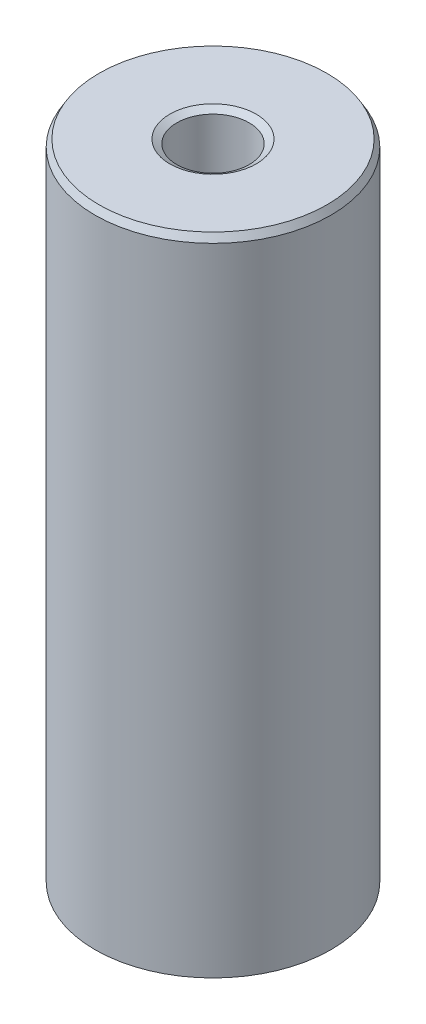
ISO-10303-21;
HEADER;
FILE_DESCRIPTION(('STEP AP214'),'2;1');
FILE_NAME('part.step','',(''),(''),'','','');
FILE_SCHEMA(('AUTOMOTIVE_DESIGN { 1 0 10303 214 1 1 1 1 }'));
ENDSEC;
DATA;
#1=APPLICATION_CONTEXT('core data for automotive mechanical design processes');
#2=APPLICATION_PROTOCOL_DEFINITION('international standard','automotive_design',2000,#1);
#3=PRODUCT_CONTEXT('',#1,'mechanical');
#4=PRODUCT('Part','Part','',(#3));
#5=PRODUCT_RELATED_PRODUCT_CATEGORY('part','',(#4));
#6=PRODUCT_DEFINITION_FORMATION('','',#4);
#7=PRODUCT_DEFINITION_CONTEXT('part definition',#1,'design');
#8=PRODUCT_DEFINITION('design','',#6,#7);
#9=PRODUCT_DEFINITION_SHAPE('','',#8);
#10=(LENGTH_UNIT() NAMED_UNIT(*) SI_UNIT(.MILLI.,.METRE.));
#11=(NAMED_UNIT(*) PLANE_ANGLE_UNIT() SI_UNIT($,.RADIAN.));
#12=(NAMED_UNIT(*) SI_UNIT($,.STERADIAN.) SOLID_ANGLE_UNIT());
#13=UNCERTAINTY_MEASURE_WITH_UNIT(LENGTH_MEASURE(1.E-05),#10,'distance_accuracy_value','');
#14=(GEOMETRIC_REPRESENTATION_CONTEXT(3) GLOBAL_UNCERTAINTY_ASSIGNED_CONTEXT((#13)) GLOBAL_UNIT_ASSIGNED_CONTEXT((#10,
#11,#12)) REPRESENTATION_CONTEXT('',''));
#15=CARTESIAN_POINT('',(0.,0.,0.));
#16=DIRECTION('',(0.,0.,1.));
#17=DIRECTION('',(1.,0.,0.));
#18=AXIS2_PLACEMENT_3D('',#15,#16,#17);
#19=CARTESIAN_POINT('',(0.,27.4315603410785,0.));
#20=DIRECTION('',(0.,-1.,0.));
#21=DIRECTION('',(0.,0.,-1.));
#22=AXIS2_PLACEMENT_3D('',#19,#20,#21);
#23=CYLINDRICAL_SURFACE('',#22,5.);
#24=CARTESIAN_POINT('',(0.,0.170210936840057,0.));
#25=DIRECTION('',(0.,1.,0.));
#26=DIRECTION('',(0.,0.,1.));
#27=AXIS2_PLACEMENT_3D('',#24,#25,#26);
#28=CIRCLE('',#27,5.);
#29=CARTESIAN_POINT('',(0.,0.170210936840054,-5.));
#30=VERTEX_POINT('',#29);
#31=EDGE_CURVE('E10',#30,#30,#28,.T.);
#32=CARTESIAN_POINT('',(0.,27.1367463504676,0.));
#33=DIRECTION('',(0.,1.,0.));
#34=DIRECTION('',(0.,0.,1.));
#35=AXIS2_PLACEMENT_3D('',#32,#33,#34);
#36=CIRCLE('',#35,5.);
#37=CARTESIAN_POINT('',(0.,27.1367463504676,-5.));
#38=VERTEX_POINT('',#37);
#39=EDGE_CURVE('E50',#38,#38,#36,.F.);
#40=CARTESIAN_POINT('',(0.,0.170210936840054,-5.));
#41=CARTESIAN_POINT('',(0.,0.451112347398675,-5.));
#42=CARTESIAN_POINT('',(0.,0.732013757957295,-5.));
#43=CARTESIAN_POINT('',(0.,1.29381657907454,-5.));
#44=CARTESIAN_POINT('',(0.,1.57471798963316,-5.));
#45=CARTESIAN_POINT('',(0.,2.1365208107504,-5.));
#46=CARTESIAN_POINT('',(0.,2.41742222130902,-5.));
#47=CARTESIAN_POINT('',(0.,2.97922504242626,-5.));
#48=CARTESIAN_POINT('',(0.,3.26012645298488,-5.));
#49=CARTESIAN_POINT('',(0.,3.82192927410212,-5.));
#50=CARTESIAN_POINT('',(0.,4.10283068466074,-5.));
#51=CARTESIAN_POINT('',(0.,4.66463350577798,-5.));
#52=CARTESIAN_POINT('',(0.,4.9455349163366,-5.));
#53=CARTESIAN_POINT('',(0.,5.50733773745384,-5.));
#54=CARTESIAN_POINT('',(0.,5.78823914801246,-5.));
#55=CARTESIAN_POINT('',(0.,6.3500419691297,-5.));
#56=CARTESIAN_POINT('',(0.,6.63094337968832,-5.));
#57=CARTESIAN_POINT('',(0.,7.19274620080556,-5.));
#58=CARTESIAN_POINT('',(0.,7.47364761136418,-5.));
#59=CARTESIAN_POINT('',(0.,8.03545043248142,-5.));
#60=CARTESIAN_POINT('',(0.,8.31635184304004,-5.));
#61=CARTESIAN_POINT('',(0.,8.87815466415728,-5.));
#62=CARTESIAN_POINT('',(0.,9.1590560747159,-5.));
#63=CARTESIAN_POINT('',(0.,9.72085889583314,-5.));
#64=CARTESIAN_POINT('',(0.,10.0017603063918,-5.));
#65=CARTESIAN_POINT('',(0.,10.563563127509,-5.));
#66=CARTESIAN_POINT('',(0.,10.8444645380676,-5.));
#67=CARTESIAN_POINT('',(0.,11.4062673591849,-5.));
#68=CARTESIAN_POINT('',(0.,11.6871687697435,-5.));
#69=CARTESIAN_POINT('',(0.,12.2489715908607,-5.));
#70=CARTESIAN_POINT('',(0.,12.5298730014193,-5.));
#71=CARTESIAN_POINT('',(0.,13.0916758225366,-5.));
#72=CARTESIAN_POINT('',(0.,13.3725772330952,-5.));
#73=CARTESIAN_POINT('',(0.,13.9343800542124,-5.));
#74=CARTESIAN_POINT('',(0.,14.2152814647711,-5.));
#75=CARTESIAN_POINT('',(0.,14.7770842858883,-5.));
#76=CARTESIAN_POINT('',(0.,15.0579856964469,-5.));
#77=CARTESIAN_POINT('',(0.,15.6197885175642,-5.));
#78=CARTESIAN_POINT('',(0.,15.9006899281228,-5.));
#79=CARTESIAN_POINT('',(0.,16.46249274924,-5.));
#80=CARTESIAN_POINT('',(0.,16.7433941597987,-5.));
#81=CARTESIAN_POINT('',(0.,17.3051969809159,-5.));
#82=CARTESIAN_POINT('',(0.,17.5860983914745,-5.));
#83=CARTESIAN_POINT('',(0.,18.1479012125918,-5.));
#84=CARTESIAN_POINT('',(0.,18.4288026231504,-5.));
#85=CARTESIAN_POINT('',(0.,18.9906054442676,-5.));
#86=CARTESIAN_POINT('',(0.,19.2715068548262,-5.));
#87=CARTESIAN_POINT('',(0.,19.8333096759435,-5.));
#88=CARTESIAN_POINT('',(0.,20.1142110865021,-5.));
#89=CARTESIAN_POINT('',(0.,20.6760139076193,-5.));
#90=CARTESIAN_POINT('',(0.,20.956915318178,-5.));
#91=CARTESIAN_POINT('',(0.,21.5187181392952,-5.));
#92=CARTESIAN_POINT('',(0.,21.7996195498538,-5.));
#93=CARTESIAN_POINT('',(0.,22.3614223709711,-5.));
#94=CARTESIAN_POINT('',(0.,22.6423237815297,-5.));
#95=CARTESIAN_POINT('',(0.,23.2041266026469,-5.));
#96=CARTESIAN_POINT('',(0.,23.4850280132055,-5.));
#97=CARTESIAN_POINT('',(0.,24.0468308343228,-5.));
#98=CARTESIAN_POINT('',(0.,24.3277322448814,-5.));
#99=CARTESIAN_POINT('',(0.,24.8895350659986,-5.));
#100=CARTESIAN_POINT('',(0.,25.1704364765573,-5.));
#101=CARTESIAN_POINT('',(0.,25.7322392976745,-5.));
#102=CARTESIAN_POINT('',(0.,26.0131407082331,-5.));
#103=CARTESIAN_POINT('',(0.,26.5749435293504,-5.));
#104=CARTESIAN_POINT('',(0.,26.855844939909,-5.));
#105=CARTESIAN_POINT('',(0.,27.1367463504676,-5.));
#106=B_SPLINE_CURVE_WITH_KNOTS('',3,(#40,#41,#42,#43,#44,#45,#46,#47,#48,#49,#50,#51,#52,#53,
#54,#55,#56,#57,#58,#59,#60,#61,#62,#63,#64,#65,#66,#67,#68,#69,#70,#71,#72,#73,#74,#75,#76,#77,
#78,#79,#80,#81,#82,#83,#84,#85,#86,#87,#88,#89,#90,#91,#92,#93,#94,#95,#96,#97,#98,#99,#100,
#101,#102,#103,#104,#105),.UNSPECIFIED.,.F.,.F.,(4,2,2,2,2,2,2,2,2,2,2,2,2,2,2,2,2,2,2,2,2,2,2,
2,2,2,2,2,2,2,2,2,4),(0.,0.842704231675862,1.68540846335172,2.52811269502758,3.37081692670344,
4.2135211583793,5.05622539005517,5.89892962173102,6.74163385340689,7.58433808508275,
8.42704231675861,9.26974654843447,10.1124507801103,10.9551550117862,11.7978592434621,
12.6405634751379,13.4832677068138,14.3259719384896,15.1686761701655,16.0113804018414,
16.8540846335172,17.6967888651931,18.5394930968689,19.3821973285448,20.2249015602207,
21.0676057918965,21.9103100235724,22.7530142552482,23.5957184869241,24.4384227186,
25.2811269502758,26.1238311819517,26.9665354136275),.UNSPECIFIED.);
#107=EDGE_CURVE('BSEAM39',#30,#38,#106,.T.);
#108=ORIENTED_EDGE('',*,*,#31,.T.);
#109=ORIENTED_EDGE('',*,*,#39,.T.);
#110=ORIENTED_EDGE('',*,*,#107,.T.);
#111=ORIENTED_EDGE('',*,*,#107,.F.);
#112=EDGE_LOOP('',(#108,#110,#109,#111));
#113=FACE_BOUND('',#112,.T.);
#114=ADVANCED_FACE('F39',(#113),#23,.T.);
#115=CARTESIAN_POINT('',(0.,27.4315603410785,0.));
#116=DIRECTION('',(0.,1.,0.));
#117=DIRECTION('',(0.,0.,1.));
#118=AXIS2_PLACEMENT_3D('',#115,#116,#117);
#119=PLANE('',#118);
#120=CARTESIAN_POINT('',(0.,27.4315603410785,0.));
#121=DIRECTION('',(0.,1.,0.));
#122=DIRECTION('',(0.,0.,1.));
#123=AXIS2_PLACEMENT_3D('',#120,#121,#122);
#124=CIRCLE('',#123,1.83019866154307);
#125=CARTESIAN_POINT('',(0.,27.4315603410785,1.83019866154307));
#126=VERTEX_POINT('',#125);
#127=EDGE_CURVE('E58',#126,#126,#124,.F.);
#128=ORIENTED_EDGE('',*,*,#127,.T.);
#129=EDGE_LOOP('',(#128));
#130=FACE_BOUND('',#129,.T.);
#131=CARTESIAN_POINT('',(0.,27.4315603410785,0.));
#132=DIRECTION('',(0.,1.,0.));
#133=DIRECTION('',(0.,0.,1.));
#134=AXIS2_PLACEMENT_3D('',#131,#132,#133);
#135=CIRCLE('',#134,4.82978906315996);
#136=CARTESIAN_POINT('',(0.,27.4315603410785,4.82978906315996));
#137=VERTEX_POINT('',#136);
#138=EDGE_CURVE('E61',#137,#137,#135,.T.);
#139=ORIENTED_EDGE('',*,*,#138,.T.);
#140=EDGE_LOOP('',(#139));
#141=FACE_BOUND('',#140,.T.);
#142=ADVANCED_FACE('F88',(#130,#141),#119,.T.);
#143=CARTESIAN_POINT('',(0.,0.,0.));
#144=DIRECTION('',(0.,1.,0.));
#145=DIRECTION('',(0.,0.,1.));
#146=AXIS2_PLACEMENT_3D('',#143,#144,#145);
#147=PLANE('',#146);
#148=CARTESIAN_POINT('',(0.,0.,0.));
#149=DIRECTION('',(0.,1.,0.));
#150=DIRECTION('',(0.,0.,1.));
#151=AXIS2_PLACEMENT_3D('',#148,#149,#150);
#152=CIRCLE('',#151,1.70559560777225);
#153=CARTESIAN_POINT('',(0.,0.,1.70559560777225));
#154=VERTEX_POINT('',#153);
#155=EDGE_CURVE('E51',#154,#154,#152,.T.);
#156=ORIENTED_EDGE('',*,*,#155,.T.);
#157=EDGE_LOOP('',(#156));
#158=FACE_BOUND('',#157,.T.);
#159=CARTESIAN_POINT('',(0.,0.,0.));
#160=DIRECTION('',(0.,1.,0.));
#161=DIRECTION('',(0.,0.,1.));
#162=AXIS2_PLACEMENT_3D('',#159,#160,#161);
#163=CIRCLE('',#162,4.70518600938912);
#164=CARTESIAN_POINT('',(0.,0.,4.70518600938912));
#165=VERTEX_POINT('',#164);
#166=EDGE_CURVE('E54',#165,#165,#163,.F.);
#167=ORIENTED_EDGE('',*,*,#166,.T.);
#168=EDGE_LOOP('',(#167));
#169=FACE_BOUND('',#168,.T.);
#170=ADVANCED_FACE('F83',(#158,#169),#147,.F.);
#171=CARTESIAN_POINT('',(0.,27.4315603410785,0.));
#172=DIRECTION('',(0.,-1.,0.));
#173=DIRECTION('',(0.,0.,-1.));
#174=AXIS2_PLACEMENT_3D('',#171,#172,#173);
#175=CYLINDRICAL_SURFACE('',#174,1.53538467093221);
#176=CARTESIAN_POINT('',(0.,27.2613494042384,0.));
#177=DIRECTION('',(0.,1.,0.));
#178=DIRECTION('',(0.,0.,1.));
#179=AXIS2_PLACEMENT_3D('',#176,#177,#178);
#180=CIRCLE('',#179,1.53538467093221);
#181=CARTESIAN_POINT('',(0.,27.2613494042384,-1.53538467093221));
#182=VERTEX_POINT('',#181);
#183=EDGE_CURVE('E67',#182,#182,#180,.T.);
#184=CARTESIAN_POINT('',(0.,0.294813990610859,0.));
#185=DIRECTION('',(0.,1.,0.));
#186=DIRECTION('',(0.,0.,1.));
#187=AXIS2_PLACEMENT_3D('',#184,#185,#186);
#188=CIRCLE('',#187,1.53538467093221);
#189=CARTESIAN_POINT('',(0.,0.294813990610855,-1.53538467093221));
#190=VERTEX_POINT('',#189);
#191=EDGE_CURVE('E69',#190,#190,#188,.F.);
#192=CARTESIAN_POINT('',(0.,27.2613494042384,-1.53538467093221));
#193=CARTESIAN_POINT('',(0.,26.9804479936798,-1.53538467093221));
#194=CARTESIAN_POINT('',(0.,26.6995465831212,-1.53538467093221));
#195=CARTESIAN_POINT('',(0.,26.1377437620039,-1.53538467093221));
#196=CARTESIAN_POINT('',(0.,25.8568423514453,-1.53538467093221));
#197=CARTESIAN_POINT('',(0.,25.2950395303281,-1.53538467093221));
#198=CARTESIAN_POINT('',(0.,25.0141381197694,-1.53538467093221));
#199=CARTESIAN_POINT('',(0.,24.4523352986522,-1.53538467093221));
#200=CARTESIAN_POINT('',(0.,24.1714338880936,-1.53538467093221));
#201=CARTESIAN_POINT('',(0.,23.6096310669763,-1.53538467093221));
#202=CARTESIAN_POINT('',(0.,23.3287296564177,-1.53538467093221));
#203=CARTESIAN_POINT('',(0.,22.7669268353005,-1.53538467093221));
#204=CARTESIAN_POINT('',(0.,22.4860254247419,-1.53538467093221));
#205=CARTESIAN_POINT('',(0.,21.9242226036246,-1.53538467093221));
#206=CARTESIAN_POINT('',(0.,21.643321193066,-1.53538467093221));
#207=CARTESIAN_POINT('',(0.,21.0815183719488,-1.53538467093221));
#208=CARTESIAN_POINT('',(0.,20.8006169613901,-1.53538467093221));
#209=CARTESIAN_POINT('',(0.,20.2388141402729,-1.53538467093221));
#210=CARTESIAN_POINT('',(0.,19.9579127297143,-1.53538467093221));
#211=CARTESIAN_POINT('',(0.,19.396109908597,-1.53538467093221));
#212=CARTESIAN_POINT('',(0.,19.1152084980384,-1.53538467093221));
#213=CARTESIAN_POINT('',(0.,18.5534056769212,-1.53538467093221));
#214=CARTESIAN_POINT('',(0.,18.2725042663626,-1.53538467093221));
#215=CARTESIAN_POINT('',(0.,17.7107014452453,-1.53538467093221));
#216=CARTESIAN_POINT('',(0.,17.4298000346867,-1.53538467093221));
#217=CARTESIAN_POINT('',(0.,16.8679972135695,-1.53538467093221));
#218=CARTESIAN_POINT('',(0.,16.5870958030108,-1.53538467093221));
#219=CARTESIAN_POINT('',(0.,16.0252929818936,-1.53538467093221));
#220=CARTESIAN_POINT('',(0.,15.744391571335,-1.53538467093221));
#221=CARTESIAN_POINT('',(0.,15.1825887502177,-1.53538467093221));
#222=CARTESIAN_POINT('',(0.,14.9016873396591,-1.53538467093221));
#223=CARTESIAN_POINT('',(0.,14.3398845185419,-1.53538467093221));
#224=CARTESIAN_POINT('',(0.,14.0589831079833,-1.53538467093221));
#225=CARTESIAN_POINT('',(0.,13.497180286866,-1.53538467093221));
#226=CARTESIAN_POINT('',(0.,13.2162788763074,-1.53538467093221));
#227=CARTESIAN_POINT('',(0.,12.6544760551901,-1.53538467093221));
#228=CARTESIAN_POINT('',(0.,12.3735746446315,-1.53538467093221));
#229=CARTESIAN_POINT('',(0.,11.8117718235143,-1.53538467093221));
#230=CARTESIAN_POINT('',(0.,11.5308704129557,-1.53538467093221));
#231=CARTESIAN_POINT('',(0.,10.9690675918384,-1.53538467093221));
#232=CARTESIAN_POINT('',(0.,10.6881661812798,-1.53538467093221));
#233=CARTESIAN_POINT('',(0.,10.1263633601626,-1.53538467093221));
#234=CARTESIAN_POINT('',(0.,9.84546194960395,-1.53538467093221));
#235=CARTESIAN_POINT('',(0.,9.28365912848671,-1.53538467093221));
#236=CARTESIAN_POINT('',(0.,9.00275771792808,-1.53538467093221));
#237=CARTESIAN_POINT('',(0.,8.44095489681084,-1.53538467093221));
#238=CARTESIAN_POINT('',(0.,8.16005348625222,-1.53538467093221));
#239=CARTESIAN_POINT('',(0.,7.59825066513498,-1.53538467093221));
#240=CARTESIAN_POINT('',(0.,7.31734925457636,-1.53538467093221));
#241=CARTESIAN_POINT('',(0.,6.75554643345912,-1.53538467093221));
#242=CARTESIAN_POINT('',(0.,6.4746450229005,-1.53538467093221));
#243=CARTESIAN_POINT('',(0.,5.91284220178326,-1.53538467093221));
#244=CARTESIAN_POINT('',(0.,5.63194079122464,-1.53538467093221));
#245=CARTESIAN_POINT('',(0.,5.0701379701074,-1.53538467093221));
#246=CARTESIAN_POINT('',(0.,4.78923655954878,-1.53538467093221));
#247=CARTESIAN_POINT('',(0.,4.22743373843154,-1.53538467093221));
#248=CARTESIAN_POINT('',(0.,3.94653232787292,-1.53538467093221));
#249=CARTESIAN_POINT('',(0.,3.38472950675568,-1.53538467093221));
#250=CARTESIAN_POINT('',(0.,3.10382809619706,-1.53538467093221));
#251=CARTESIAN_POINT('',(0.,2.54202527507982,-1.53538467093221));
#252=CARTESIAN_POINT('',(0.,2.2611238645212,-1.53538467093221));
#253=CARTESIAN_POINT('',(0.,1.69932104340396,-1.53538467093221));
#254=CARTESIAN_POINT('',(0.,1.41841963284534,-1.53538467093221));
#255=CARTESIAN_POINT('',(0.,0.856616811728097,-1.53538467093221));
#256=CARTESIAN_POINT('',(0.,0.575715401169476,-1.53538467093221));
#257=CARTESIAN_POINT('',(0.,0.294813990610855,-1.53538467093221));
#258=B_SPLINE_CURVE_WITH_KNOTS('',3,(#192,#193,#194,#195,#196,#197,#198,#199,#200,#201,#202,
#203,#204,#205,#206,#207,#208,#209,#210,#211,#212,#213,#214,#215,#216,#217,#218,#219,#220,#221,
#222,#223,#224,#225,#226,#227,#228,#229,#230,#231,#232,#233,#234,#235,#236,#237,#238,#239,#240,
#241,#242,#243,#244,#245,#246,#247,#248,#249,#250,#251,#252,#253,#254,#255,#256,#257),
.UNSPECIFIED.,.F.,.F.,(4,2,2,2,2,2,2,2,2,2,2,2,2,2,2,2,2,2,2,2,2,2,2,2,2,2,2,2,2,2,2,2,4),(0.,
0.842704231675859,1.68540846335172,2.52811269502758,3.37081692670344,4.2135211583793,
5.05622539005516,5.89892962173102,6.74163385340688,7.58433808508275,8.42704231675861,
9.26974654843447,10.1124507801103,10.9551550117862,11.797859243462,12.6405634751379,
13.4832677068138,14.3259719384896,15.1686761701655,16.0113804018414,16.8540846335172,
17.6967888651931,18.5394930968689,19.3821973285448,20.2249015602207,21.0676057918965,
21.9103100235724,22.7530142552482,23.5957184869241,24.4384227186,25.2811269502758,
26.1238311819517,26.9665354136275),.UNSPECIFIED.);
#259=EDGE_CURVE('BSEAM71',#182,#190,#258,.T.);
#260=ORIENTED_EDGE('',*,*,#183,.T.);
#261=ORIENTED_EDGE('',*,*,#191,.T.);
#262=ORIENTED_EDGE('',*,*,#259,.T.);
#263=ORIENTED_EDGE('',*,*,#259,.F.);
#264=EDGE_LOOP('',(#260,#262,#261,#263));
#265=FACE_BOUND('',#264,.T.);
#266=ADVANCED_FACE('F71',(#265),#175,.F.);
#267=CARTESIAN_POINT('',(0.,27.2613494042384,0.));
#268=DIRECTION('',(0.,1.,0.));
#269=DIRECTION('',(0.,0.,1.));
#270=AXIS2_PLACEMENT_3D('',#267,#268,#269);
#271=CONICAL_SURFACE('',#270,1.53538467093221,1.0471975511966);
#272=ORIENTED_EDGE('',*,*,#127,.F.);
#273=EDGE_LOOP('',(#272));
#274=FACE_BOUND('',#273,.T.);
#275=ORIENTED_EDGE('',*,*,#183,.F.);
#276=EDGE_LOOP('',(#275));
#277=FACE_BOUND('',#276,.T.);
#278=ADVANCED_FACE('F77',(#274,#277),#271,.F.);
#279=CARTESIAN_POINT('',(0.,0.,0.));
#280=DIRECTION('',(0.,-1.,0.));
#281=DIRECTION('',(0.,0.,-1.));
#282=AXIS2_PLACEMENT_3D('',#279,#280,#281);
#283=CONICAL_SURFACE('',#282,1.70559560777225,0.523598775598292);
#284=ORIENTED_EDGE('',*,*,#191,.F.);
#285=EDGE_LOOP('',(#284));
#286=FACE_BOUND('',#285,.T.);
#287=ORIENTED_EDGE('',*,*,#155,.F.);
#288=EDGE_LOOP('',(#287));
#289=FACE_BOUND('',#288,.T.);
#290=ADVANCED_FACE('F73',(#286,#289),#283,.F.);
#291=CARTESIAN_POINT('',(0.,0.170210936840057,0.));
#292=DIRECTION('',(0.,1.,0.));
#293=DIRECTION('',(0.,0.,1.));
#294=AXIS2_PLACEMENT_3D('',#291,#292,#293);
#295=CONICAL_SURFACE('',#294,5.,1.04719755119661);
#296=ORIENTED_EDGE('',*,*,#166,.F.);
#297=EDGE_LOOP('',(#296));
#298=FACE_BOUND('',#297,.T.);
#299=ORIENTED_EDGE('',*,*,#31,.F.);
#300=EDGE_LOOP('',(#299));
#301=FACE_BOUND('',#300,.T.);
#302=ADVANCED_FACE('F76',(#298,#301),#295,.T.);
#303=CARTESIAN_POINT('',(0.,27.4315603410785,0.));
#304=DIRECTION('',(0.,-1.,0.));
#305=DIRECTION('',(0.,0.,-1.));
#306=AXIS2_PLACEMENT_3D('',#303,#304,#305);
#307=CONICAL_SURFACE('',#306,4.82978906315996,0.5235987755983);
#308=ORIENTED_EDGE('',*,*,#39,.F.);
#309=EDGE_LOOP('',(#308));
#310=FACE_BOUND('',#309,.T.);
#311=ORIENTED_EDGE('',*,*,#138,.F.);
#312=EDGE_LOOP('',(#311));
#313=FACE_BOUND('',#312,.T.);
#314=ADVANCED_FACE('F45',(#310,#313),#307,.T.);
#315=CLOSED_SHELL('',(#114,#142,#170,#266,#278,#290,#302,#314));
#316=MANIFOLD_SOLID_BREP('B2',#315);
#317=ADVANCED_BREP_SHAPE_REPRESENTATION('',(#18,#316),#14);
#318=SHAPE_DEFINITION_REPRESENTATION(#9,#317);
ENDSEC;
END-ISO-10303-21;
